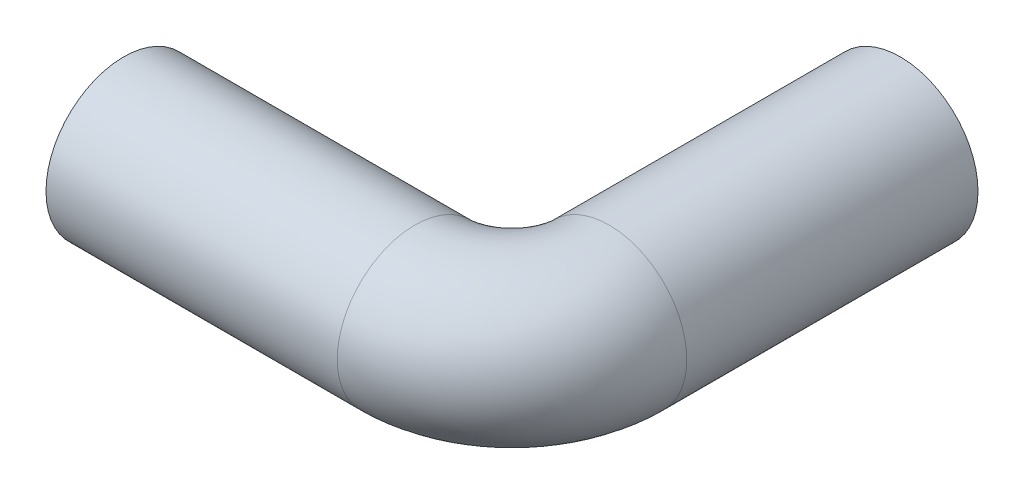
ISO-10303-21;
HEADER;
FILE_DESCRIPTION(('STEP AP214'),'2;1');
FILE_NAME('part.step','',(''),(''),'','','');
FILE_SCHEMA(('AUTOMOTIVE_DESIGN { 1 0 10303 214 1 1 1 1 }'));
ENDSEC;
DATA;
#1=APPLICATION_CONTEXT('core data for automotive mechanical design processes');
#2=APPLICATION_PROTOCOL_DEFINITION('international standard','automotive_design',2000,#1);
#3=PRODUCT_CONTEXT('',#1,'mechanical');
#4=PRODUCT('Part','Part','',(#3));
#5=PRODUCT_RELATED_PRODUCT_CATEGORY('part','',(#4));
#6=PRODUCT_DEFINITION_FORMATION('','',#4);
#7=PRODUCT_DEFINITION_CONTEXT('part definition',#1,'design');
#8=PRODUCT_DEFINITION('design','',#6,#7);
#9=PRODUCT_DEFINITION_SHAPE('','',#8);
#10=(LENGTH_UNIT() NAMED_UNIT(*) SI_UNIT(.MILLI.,.METRE.));
#11=(NAMED_UNIT(*) PLANE_ANGLE_UNIT() SI_UNIT($,.RADIAN.));
#12=(NAMED_UNIT(*) SI_UNIT($,.STERADIAN.) SOLID_ANGLE_UNIT());
#13=UNCERTAINTY_MEASURE_WITH_UNIT(LENGTH_MEASURE(1.E-05),#10,'distance_accuracy_value','');
#14=(GEOMETRIC_REPRESENTATION_CONTEXT(3) GLOBAL_UNCERTAINTY_ASSIGNED_CONTEXT((#13)) GLOBAL_UNIT_ASSIGNED_CONTEXT((#10,
#11,#12)) REPRESENTATION_CONTEXT('',''));
#15=CARTESIAN_POINT('',(0.,0.,0.));
#16=DIRECTION('',(0.,0.,1.));
#17=DIRECTION('',(1.,0.,0.));
#18=AXIS2_PLACEMENT_3D('',#15,#16,#17);
#19=CARTESIAN_POINT('',(0.,0.,0.));
#20=DIRECTION('',(-1.,0.,0.));
#21=DIRECTION('',(0.,0.,1.));
#22=AXIS2_PLACEMENT_3D('',#19,#20,#21);
#23=PLANE('',#22);
#24=CARTESIAN_POINT('',(0.,0.,0.));
#25=DIRECTION('',(-1.,0.,0.));
#26=DIRECTION('',(0.,0.,1.));
#27=AXIS2_PLACEMENT_3D('',#24,#25,#26);
#28=CIRCLE('',#27,3.5);
#29=CARTESIAN_POINT('',(0.,0.,3.5));
#30=VERTEX_POINT('',#29);
#31=EDGE_CURVE('E70',#30,#30,#28,.T.);
#32=ORIENTED_EDGE('',*,*,#31,.F.);
#33=EDGE_LOOP('',(#32));
#34=FACE_BOUND('',#33,.T.);
#35=CARTESIAN_POINT('',(0.,0.,0.));
#36=DIRECTION('',(-1.,0.,0.));
#37=DIRECTION('',(0.,0.,1.));
#38=AXIS2_PLACEMENT_3D('',#35,#36,#37);
#39=CIRCLE('',#38,4.);
#40=CARTESIAN_POINT('',(0.,0.,4.));
#41=VERTEX_POINT('',#40);
#42=EDGE_CURVE('E61',#41,#41,#39,.T.);
#43=ORIENTED_EDGE('',*,*,#42,.T.);
#44=EDGE_LOOP('',(#43));
#45=FACE_BOUND('',#44,.T.);
#46=ADVANCED_FACE('F47',(#34,#45),#23,.T.);
#47=CARTESIAN_POINT('',(20.,0.,-20.));
#48=DIRECTION('',(0.,0.,1.));
#49=DIRECTION('',(1.,0.,0.));
#50=AXIS2_PLACEMENT_3D('',#47,#48,#49);
#51=PLANE('',#50);
#52=CARTESIAN_POINT('',(20.,0.,-20.));
#53=DIRECTION('',(0.,0.,1.));
#54=DIRECTION('',(1.,0.,0.));
#55=AXIS2_PLACEMENT_3D('',#52,#53,#54);
#56=CIRCLE('',#55,3.5);
#57=CARTESIAN_POINT('',(23.5,0.,-20.));
#58=VERTEX_POINT('',#57);
#59=EDGE_CURVE('E66',#58,#58,#56,.T.);
#60=ORIENTED_EDGE('',*,*,#59,.T.);
#61=EDGE_LOOP('',(#60));
#62=FACE_BOUND('',#61,.T.);
#63=CARTESIAN_POINT('',(20.,0.,-20.));
#64=DIRECTION('',(0.,0.,1.));
#65=DIRECTION('',(1.,0.,0.));
#66=AXIS2_PLACEMENT_3D('',#63,#64,#65);
#67=CIRCLE('',#66,4.);
#68=CARTESIAN_POINT('',(24.,0.,-20.));
#69=VERTEX_POINT('',#68);
#70=EDGE_CURVE('E11',#69,#69,#67,.T.);
#71=ORIENTED_EDGE('',*,*,#70,.F.);
#72=EDGE_LOOP('',(#71));
#73=FACE_BOUND('',#72,.T.);
#74=ADVANCED_FACE('F90',(#62,#73),#51,.F.);
#75=CARTESIAN_POINT('',(0.,0.,0.));
#76=DIRECTION('',(1.,0.,0.));
#77=DIRECTION('',(0.,0.,-1.));
#78=AXIS2_PLACEMENT_3D('',#75,#76,#77);
#79=CYLINDRICAL_SURFACE('',#78,4.);
#80=CARTESIAN_POINT('',(15.,0.,0.));
#81=DIRECTION('',(-1.,0.,0.));
#82=DIRECTION('',(0.,0.,1.));
#83=AXIS2_PLACEMENT_3D('',#80,#81,#82);
#84=CIRCLE('',#83,4.);
#85=CARTESIAN_POINT('',(14.9999999999999,0.,4.));
#86=VERTEX_POINT('',#85);
#87=EDGE_CURVE('E57',#86,#86,#84,.T.);
#88=ORIENTED_EDGE('',*,*,#87,.T.);
#89=EDGE_LOOP('',(#88));
#90=FACE_BOUND('',#89,.T.);
#91=ORIENTED_EDGE('',*,*,#42,.F.);
#92=EDGE_LOOP('',(#91));
#93=FACE_BOUND('',#92,.T.);
#94=ADVANCED_FACE('F94',(#90,#93),#79,.T.);
#95=CARTESIAN_POINT('',(15.,0.,-5.));
#96=DIRECTION('',(0.,1.,0.));
#97=DIRECTION('',(0.,0.,1.));
#98=AXIS2_PLACEMENT_3D('',#95,#96,#97);
#99=TOROIDAL_SURFACE('',#98,5.,4.);
#100=CARTESIAN_POINT('',(20.0000000000001,0.,-4.99999999999989));
#101=DIRECTION('',(0.,0.,1.));
#102=DIRECTION('',(1.,0.,0.));
#103=AXIS2_PLACEMENT_3D('',#100,#101,#102);
#104=CIRCLE('',#103,4.);
#105=CARTESIAN_POINT('',(24.,0.,-4.99999999999981));
#106=VERTEX_POINT('',#105);
#107=EDGE_CURVE('E53',#106,#106,#104,.T.);
#108=CARTESIAN_POINT('',(15.,0.,-5.));
#109=DIRECTION('',(0.,1.,0.));
#110=DIRECTION('',(0.,0.,1.));
#111=AXIS2_PLACEMENT_3D('',#108,#109,#110);
#112=CIRCLE('',#111,9.);
#113=EDGE_CURVE('',#86,#106,#112,.T.);
#114=ORIENTED_EDGE('',*,*,#87,.F.);
#115=ORIENTED_EDGE('',*,*,#107,.T.);
#116=ORIENTED_EDGE('',*,*,#113,.T.);
#117=ORIENTED_EDGE('',*,*,#113,.F.);
#118=EDGE_LOOP('',(#114,#116,#115,#117));
#119=FACE_BOUND('',#118,.T.);
#120=ADVANCED_FACE('F96',(#119),#99,.T.);
#121=CARTESIAN_POINT('',(20.,0.,-5.00000000000004));
#122=DIRECTION('',(0.,0.,-1.));
#123=DIRECTION('',(-1.,0.,0.));
#124=AXIS2_PLACEMENT_3D('',#121,#122,#123);
#125=CYLINDRICAL_SURFACE('',#124,4.);
#126=ORIENTED_EDGE('',*,*,#70,.T.);
#127=EDGE_LOOP('',(#126));
#128=FACE_BOUND('',#127,.T.);
#129=ORIENTED_EDGE('',*,*,#107,.F.);
#130=EDGE_LOOP('',(#129));
#131=FACE_BOUND('',#130,.T.);
#132=ADVANCED_FACE('F84',(#128,#131),#125,.T.);
#133=CARTESIAN_POINT('',(0.,0.,0.));
#134=DIRECTION('',(1.,0.,0.));
#135=DIRECTION('',(0.,0.,-1.));
#136=AXIS2_PLACEMENT_3D('',#133,#134,#135);
#137=CYLINDRICAL_SURFACE('',#136,3.5);
#138=CARTESIAN_POINT('',(15.,0.,0.));
#139=DIRECTION('',(1.,0.,0.));
#140=DIRECTION('',(0.,0.,-1.));
#141=AXIS2_PLACEMENT_3D('',#138,#139,#140);
#142=CIRCLE('',#141,3.5);
#143=CARTESIAN_POINT('',(14.9999999999999,0.,3.5));
#144=VERTEX_POINT('',#143);
#145=EDGE_CURVE('E73',#144,#144,#142,.F.);
#146=ORIENTED_EDGE('',*,*,#145,.F.);
#147=EDGE_LOOP('',(#146));
#148=FACE_BOUND('',#147,.T.);
#149=ORIENTED_EDGE('',*,*,#31,.T.);
#150=EDGE_LOOP('',(#149));
#151=FACE_BOUND('',#150,.T.);
#152=ADVANCED_FACE('F81',(#148,#151),#137,.F.);
#153=CARTESIAN_POINT('',(15.,0.,-5.));
#154=DIRECTION('',(0.,1.,0.));
#155=DIRECTION('',(0.,0.,1.));
#156=AXIS2_PLACEMENT_3D('',#153,#154,#155);
#157=TOROIDAL_SURFACE('',#156,5.,3.5);
#158=CARTESIAN_POINT('',(20.,0.,-4.99999999999947));
#159=DIRECTION('',(-1.05754464284272E-13,0.,1.));
#160=DIRECTION('',(1.,0.,1.05754464284272E-13));
#161=AXIS2_PLACEMENT_3D('',#158,#159,#160);
#162=CIRCLE('',#161,3.5);
#163=CARTESIAN_POINT('',(23.5,0.,-4.9999999999991));
#164=VERTEX_POINT('',#163);
#165=EDGE_CURVE('E69',#164,#164,#162,.T.);
#166=CARTESIAN_POINT('',(15.,0.,-5.));
#167=DIRECTION('',(0.,1.,0.));
#168=DIRECTION('',(0.,0.,1.));
#169=AXIS2_PLACEMENT_3D('',#166,#167,#168);
#170=CIRCLE('',#169,8.5);
#171=EDGE_CURVE('',#144,#164,#170,.T.);
#172=ORIENTED_EDGE('',*,*,#145,.T.);
#173=ORIENTED_EDGE('',*,*,#165,.F.);
#174=ORIENTED_EDGE('',*,*,#171,.T.);
#175=ORIENTED_EDGE('',*,*,#171,.F.);
#176=EDGE_LOOP('',(#172,#174,#173,#175));
#177=FACE_BOUND('',#176,.T.);
#178=ADVANCED_FACE('F79',(#177),#157,.F.);
#179=CARTESIAN_POINT('',(20.,0.,-5.00000000000004));
#180=DIRECTION('',(0.,0.,-1.));
#181=DIRECTION('',(-1.,0.,0.));
#182=AXIS2_PLACEMENT_3D('',#179,#180,#181);
#183=CYLINDRICAL_SURFACE('',#182,3.5);
#184=ORIENTED_EDGE('',*,*,#59,.F.);
#185=EDGE_LOOP('',(#184));
#186=FACE_BOUND('',#185,.T.);
#187=ORIENTED_EDGE('',*,*,#165,.T.);
#188=EDGE_LOOP('',(#187));
#189=FACE_BOUND('',#188,.T.);
#190=ADVANCED_FACE('F91',(#186,#189),#183,.F.);
#191=CLOSED_SHELL('',(#46,#74,#94,#120,#132,#152,#178,#190));
#192=MANIFOLD_SOLID_BREP('B2',#191);
#193=ADVANCED_BREP_SHAPE_REPRESENTATION('',(#18,#192),#14);
#194=SHAPE_DEFINITION_REPRESENTATION(#9,#193);
ENDSEC;
END-ISO-10303-21;
